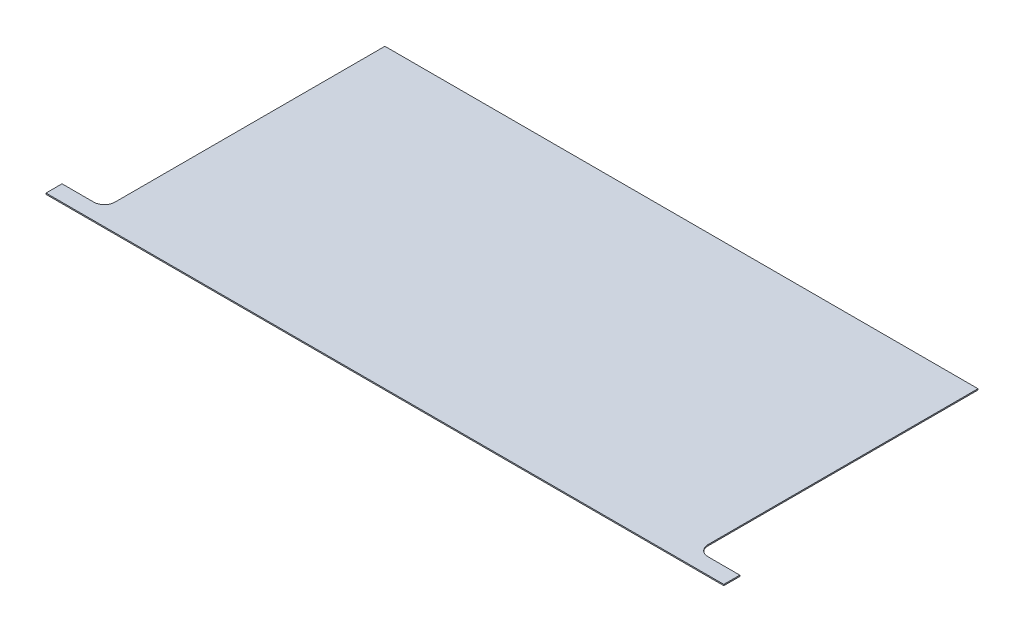
ISO-10303-21;
HEADER;
FILE_DESCRIPTION(('STEP AP214'),'2;1');
FILE_NAME('part.step','',(''),(''),'','','');
FILE_SCHEMA(('AUTOMOTIVE_DESIGN { 1 0 10303 214 1 1 1 1 }'));
ENDSEC;
DATA;
#1=APPLICATION_CONTEXT('core data for automotive mechanical design processes');
#2=APPLICATION_PROTOCOL_DEFINITION('international standard','automotive_design',2000,#1);
#3=PRODUCT_CONTEXT('',#1,'mechanical');
#4=PRODUCT('Part','Part','',(#3));
#5=PRODUCT_RELATED_PRODUCT_CATEGORY('part','',(#4));
#6=PRODUCT_DEFINITION_FORMATION('','',#4);
#7=PRODUCT_DEFINITION_CONTEXT('part definition',#1,'design');
#8=PRODUCT_DEFINITION('design','',#6,#7);
#9=PRODUCT_DEFINITION_SHAPE('','',#8);
#10=(LENGTH_UNIT() NAMED_UNIT(*) SI_UNIT(.MILLI.,.METRE.));
#11=(NAMED_UNIT(*) PLANE_ANGLE_UNIT() SI_UNIT($,.RADIAN.));
#12=(NAMED_UNIT(*) SI_UNIT($,.STERADIAN.) SOLID_ANGLE_UNIT());
#13=UNCERTAINTY_MEASURE_WITH_UNIT(LENGTH_MEASURE(1.E-05),#10,'distance_accuracy_value','');
#14=(GEOMETRIC_REPRESENTATION_CONTEXT(3) GLOBAL_UNCERTAINTY_ASSIGNED_CONTEXT((#13)) GLOBAL_UNIT_ASSIGNED_CONTEXT((#10,
#11,#12)) REPRESENTATION_CONTEXT('',''));
#15=CARTESIAN_POINT('',(0.,0.,0.));
#16=DIRECTION('',(0.,0.,1.));
#17=DIRECTION('',(1.,0.,0.));
#18=AXIS2_PLACEMENT_3D('',#15,#16,#17);
#19=CARTESIAN_POINT('',(203.2,0.3556,0.));
#20=DIRECTION('',(0.,0.,-1.));
#21=DIRECTION('',(-1.,0.,0.));
#22=AXIS2_PLACEMENT_3D('',#19,#20,#21);
#23=PLANE('',#22);
#24=DIRECTION('',(1.,0.,0.));
#25=VECTOR('',#24,1.);
#26=CARTESIAN_POINT('',(203.2,0.,0.));
#27=LINE('',#26,#25);
#28=CARTESIAN_POINT('',(0.,0.,0.));
#29=VERTEX_POINT('',#28);
#30=CARTESIAN_POINT('',(203.2,0.,0.));
#31=VERTEX_POINT('',#30);
#32=EDGE_CURVE('E124',#29,#31,#27,.T.);
#33=ORIENTED_EDGE('',*,*,#32,.T.);
#34=DIRECTION('',(0.,-1.,0.));
#35=VECTOR('',#34,1.);
#36=CARTESIAN_POINT('',(203.2,0.3556,0.));
#37=LINE('',#36,#35);
#38=CARTESIAN_POINT('',(203.2,0.3556,0.));
#39=VERTEX_POINT('',#38);
#40=EDGE_CURVE('E123',#39,#31,#37,.T.);
#41=ORIENTED_EDGE('',*,*,#40,.F.);
#42=DIRECTION('',(1.,0.,0.));
#43=VECTOR('',#42,1.);
#44=CARTESIAN_POINT('',(0.,0.3556,0.));
#45=LINE('',#44,#43);
#46=CARTESIAN_POINT('',(0.,0.3556,0.));
#47=VERTEX_POINT('',#46);
#48=EDGE_CURVE('E108',#47,#39,#45,.T.);
#49=ORIENTED_EDGE('',*,*,#48,.F.);
#50=DIRECTION('',(0.,-1.,0.));
#51=VECTOR('',#50,1.);
#52=CARTESIAN_POINT('',(0.,0.3556,0.));
#53=LINE('',#52,#51);
#54=EDGE_CURVE('E146',#47,#29,#53,.T.);
#55=ORIENTED_EDGE('',*,*,#54,.T.);
#56=EDGE_LOOP('',(#33,#41,#49,#55));
#57=FACE_BOUND('',#56,.T.);
#58=ADVANCED_FACE('F32',(#57),#23,.F.);
#59=CARTESIAN_POINT('',(203.2,0.3556,-4.80000000000003));
#60=DIRECTION('',(-1.,0.,0.));
#61=DIRECTION('',(0.,0.,1.));
#62=AXIS2_PLACEMENT_3D('',#59,#60,#61);
#63=PLANE('',#62);
#64=DIRECTION('',(0.,0.,-1.));
#65=VECTOR('',#64,1.);
#66=CARTESIAN_POINT('',(203.2,0.,-4.80000000000003));
#67=LINE('',#66,#65);
#68=CARTESIAN_POINT('',(203.2,0.,-4.80000000000003));
#69=VERTEX_POINT('',#68);
#70=EDGE_CURVE('E148',#31,#69,#67,.T.);
#71=ORIENTED_EDGE('',*,*,#70,.T.);
#72=DIRECTION('',(0.,-1.,0.));
#73=VECTOR('',#72,1.);
#74=CARTESIAN_POINT('',(203.2,0.3556,-4.80000000000003));
#75=LINE('',#74,#73);
#76=CARTESIAN_POINT('',(203.2,0.3556,-4.80000000000003));
#77=VERTEX_POINT('',#76);
#78=EDGE_CURVE('E128',#77,#69,#75,.T.);
#79=ORIENTED_EDGE('',*,*,#78,.F.);
#80=DIRECTION('',(0.,0.,-1.));
#81=VECTOR('',#80,1.);
#82=CARTESIAN_POINT('',(203.2,0.3556,-4.80000000000003));
#83=LINE('',#82,#81);
#84=EDGE_CURVE('E113',#39,#77,#83,.T.);
#85=ORIENTED_EDGE('',*,*,#84,.F.);
#86=ORIENTED_EDGE('',*,*,#40,.T.);
#87=EDGE_LOOP('',(#71,#79,#85,#86));
#88=FACE_BOUND('',#87,.T.);
#89=ADVANCED_FACE('F130',(#88),#63,.F.);
#90=CARTESIAN_POINT('',(190.5,0.3556,-4.80000000000003));
#91=DIRECTION('',(0.,0.,1.));
#92=DIRECTION('',(1.,0.,0.));
#93=AXIS2_PLACEMENT_3D('',#90,#91,#92);
#94=PLANE('',#93);
#95=DIRECTION('',(-1.,0.,0.));
#96=VECTOR('',#95,1.);
#97=CARTESIAN_POINT('',(190.5,0.,-4.80000000000003));
#98=LINE('',#97,#96);
#99=CARTESIAN_POINT('',(193.675,0.,-4.80000000000003));
#100=VERTEX_POINT('',#99);
#101=EDGE_CURVE('E150',#69,#100,#98,.T.);
#102=ORIENTED_EDGE('',*,*,#101,.T.);
#103=DIRECTION('',(0.,-1.,0.));
#104=VECTOR('',#103,1.);
#105=CARTESIAN_POINT('',(193.675,0.3556,-4.80000000000003));
#106=LINE('',#105,#104);
#107=CARTESIAN_POINT('',(193.675,0.3556,-4.80000000000003));
#108=VERTEX_POINT('',#107);
#109=EDGE_CURVE('E176',#100,#108,#106,.F.);
#110=ORIENTED_EDGE('',*,*,#109,.T.);
#111=DIRECTION('',(-1.,0.,0.));
#112=VECTOR('',#111,1.);
#113=CARTESIAN_POINT('',(190.5,0.3556,-4.80000000000003));
#114=LINE('',#113,#112);
#115=EDGE_CURVE('E133',#77,#108,#114,.T.);
#116=ORIENTED_EDGE('',*,*,#115,.F.);
#117=ORIENTED_EDGE('',*,*,#78,.T.);
#118=EDGE_LOOP('',(#102,#110,#116,#117));
#119=FACE_BOUND('',#118,.T.);
#120=ADVANCED_FACE('F200',(#119),#94,.F.);
#121=CARTESIAN_POINT('',(190.5,0.3556,-88.9));
#122=DIRECTION('',(-1.,0.,0.));
#123=DIRECTION('',(0.,0.,1.));
#124=AXIS2_PLACEMENT_3D('',#121,#122,#123);
#125=PLANE('',#124);
#126=DIRECTION('',(0.,0.,-1.));
#127=VECTOR('',#126,1.);
#128=CARTESIAN_POINT('',(190.5,0.3556,-88.9));
#129=LINE('',#128,#127);
#130=CARTESIAN_POINT('',(190.5,0.3556,-7.97500000000002));
#131=VERTEX_POINT('',#130);
#132=CARTESIAN_POINT('',(190.5,0.3556,-88.9));
#133=VERTEX_POINT('',#132);
#134=EDGE_CURVE('E135',#131,#133,#129,.T.);
#135=ORIENTED_EDGE('',*,*,#134,.F.);
#136=DIRECTION('',(0.,-1.,0.));
#137=VECTOR('',#136,1.);
#138=CARTESIAN_POINT('',(190.5,0.,-7.97500000000002));
#139=LINE('',#138,#137);
#140=CARTESIAN_POINT('',(190.5,0.,-7.97500000000002));
#141=VERTEX_POINT('',#140);
#142=EDGE_CURVE('E127',#131,#141,#139,.T.);
#143=ORIENTED_EDGE('',*,*,#142,.T.);
#144=DIRECTION('',(0.,0.,-1.));
#145=VECTOR('',#144,1.);
#146=CARTESIAN_POINT('',(190.5,0.,-88.9));
#147=LINE('',#146,#145);
#148=CARTESIAN_POINT('',(190.5,0.,-88.9));
#149=VERTEX_POINT('',#148);
#150=EDGE_CURVE('E153',#141,#149,#147,.T.);
#151=ORIENTED_EDGE('',*,*,#150,.T.);
#152=DIRECTION('',(0.,-1.,0.));
#153=VECTOR('',#152,1.);
#154=CARTESIAN_POINT('',(190.5,0.3556,-88.9));
#155=LINE('',#154,#153);
#156=EDGE_CURVE('E170',#133,#149,#155,.T.);
#157=ORIENTED_EDGE('',*,*,#156,.F.);
#158=EDGE_LOOP('',(#135,#143,#151,#157));
#159=FACE_BOUND('',#158,.T.);
#160=ADVANCED_FACE('F192',(#159),#125,.F.);
#161=CARTESIAN_POINT('',(12.7,0.3556,-88.9));
#162=DIRECTION('',(0.,0.,1.));
#163=DIRECTION('',(1.,0.,0.));
#164=AXIS2_PLACEMENT_3D('',#161,#162,#163);
#165=PLANE('',#164);
#166=DIRECTION('',(-1.,0.,0.));
#167=VECTOR('',#166,1.);
#168=CARTESIAN_POINT('',(12.7,0.,-88.9));
#169=LINE('',#168,#167);
#170=CARTESIAN_POINT('',(12.7,0.,-88.9));
#171=VERTEX_POINT('',#170);
#172=EDGE_CURVE('E155',#149,#171,#169,.T.);
#173=ORIENTED_EDGE('',*,*,#172,.T.);
#174=DIRECTION('',(0.,-1.,0.));
#175=VECTOR('',#174,1.);
#176=CARTESIAN_POINT('',(12.7,0.3556,-88.9));
#177=LINE('',#176,#175);
#178=CARTESIAN_POINT('',(12.7,0.3556,-88.9));
#179=VERTEX_POINT('',#178);
#180=EDGE_CURVE('E167',#179,#171,#177,.T.);
#181=ORIENTED_EDGE('',*,*,#180,.F.);
#182=DIRECTION('',(-1.,0.,0.));
#183=VECTOR('',#182,1.);
#184=CARTESIAN_POINT('',(12.7,0.3556,-88.9));
#185=LINE('',#184,#183);
#186=EDGE_CURVE('E139',#133,#179,#185,.T.);
#187=ORIENTED_EDGE('',*,*,#186,.F.);
#188=ORIENTED_EDGE('',*,*,#156,.T.);
#189=EDGE_LOOP('',(#173,#181,#187,#188));
#190=FACE_BOUND('',#189,.T.);
#191=ADVANCED_FACE('F207',(#190),#165,.F.);
#192=CARTESIAN_POINT('',(12.7,0.3556,-88.9));
#193=DIRECTION('',(1.,0.,0.));
#194=DIRECTION('',(0.,0.,-1.));
#195=AXIS2_PLACEMENT_3D('',#192,#193,#194);
#196=PLANE('',#195);
#197=DIRECTION('',(0.,0.,1.));
#198=VECTOR('',#197,1.);
#199=CARTESIAN_POINT('',(12.7,0.,-88.9));
#200=LINE('',#199,#198);
#201=CARTESIAN_POINT('',(12.7,0.,-7.975));
#202=VERTEX_POINT('',#201);
#203=EDGE_CURVE('E157',#171,#202,#200,.T.);
#204=ORIENTED_EDGE('',*,*,#203,.T.);
#205=DIRECTION('',(0.,-1.,0.));
#206=VECTOR('',#205,1.);
#207=CARTESIAN_POINT('',(12.7,0.3556,-7.975));
#208=LINE('',#207,#206);
#209=CARTESIAN_POINT('',(12.7,0.3556,-7.975));
#210=VERTEX_POINT('',#209);
#211=EDGE_CURVE('E47',#202,#210,#208,.F.);
#212=ORIENTED_EDGE('',*,*,#211,.T.);
#213=DIRECTION('',(0.,0.,1.));
#214=VECTOR('',#213,1.);
#215=CARTESIAN_POINT('',(12.7,0.3556,-88.9));
#216=LINE('',#215,#214);
#217=EDGE_CURVE('E141',#179,#210,#216,.T.);
#218=ORIENTED_EDGE('',*,*,#217,.F.);
#219=ORIENTED_EDGE('',*,*,#180,.T.);
#220=EDGE_LOOP('',(#204,#212,#218,#219));
#221=FACE_BOUND('',#220,.T.);
#222=ADVANCED_FACE('F233',(#221),#196,.F.);
#223=CARTESIAN_POINT('',(12.7,0.3556,-4.8));
#224=DIRECTION('',(0.,0.,1.));
#225=DIRECTION('',(1.,0.,0.));
#226=AXIS2_PLACEMENT_3D('',#223,#224,#225);
#227=PLANE('',#226);
#228=DIRECTION('',(-1.,0.,0.));
#229=VECTOR('',#228,1.);
#230=CARTESIAN_POINT('',(12.7,0.3556,-4.8));
#231=LINE('',#230,#229);
#232=CARTESIAN_POINT('',(9.525,0.3556,-4.8));
#233=VERTEX_POINT('',#232);
#234=CARTESIAN_POINT('',(0.,0.3556,-4.8));
#235=VERTEX_POINT('',#234);
#236=EDGE_CURVE('E143',#233,#235,#231,.T.);
#237=ORIENTED_EDGE('',*,*,#236,.F.);
#238=DIRECTION('',(0.,-1.,0.));
#239=VECTOR('',#238,1.);
#240=CARTESIAN_POINT('',(9.525,0.,-4.8));
#241=LINE('',#240,#239);
#242=CARTESIAN_POINT('',(9.525,0.,-4.8));
#243=VERTEX_POINT('',#242);
#244=EDGE_CURVE('E178',#233,#243,#241,.T.);
#245=ORIENTED_EDGE('',*,*,#244,.T.);
#246=DIRECTION('',(-1.,0.,0.));
#247=VECTOR('',#246,1.);
#248=CARTESIAN_POINT('',(12.7,0.,-4.8));
#249=LINE('',#248,#247);
#250=CARTESIAN_POINT('',(0.,0.,-4.8));
#251=VERTEX_POINT('',#250);
#252=EDGE_CURVE('E159',#243,#251,#249,.T.);
#253=ORIENTED_EDGE('',*,*,#252,.T.);
#254=DIRECTION('',(0.,-1.,0.));
#255=VECTOR('',#254,1.);
#256=CARTESIAN_POINT('',(0.,0.3556,-4.8));
#257=LINE('',#256,#255);
#258=EDGE_CURVE('E164',#235,#251,#257,.T.);
#259=ORIENTED_EDGE('',*,*,#258,.F.);
#260=EDGE_LOOP('',(#237,#245,#253,#259));
#261=FACE_BOUND('',#260,.T.);
#262=ADVANCED_FACE('F229',(#261),#227,.F.);
#263=CARTESIAN_POINT('',(0.,0.3556,-4.8));
#264=DIRECTION('',(1.,0.,0.));
#265=DIRECTION('',(0.,0.,-1.));
#266=AXIS2_PLACEMENT_3D('',#263,#264,#265);
#267=PLANE('',#266);
#268=DIRECTION('',(0.,0.,1.));
#269=VECTOR('',#268,1.);
#270=CARTESIAN_POINT('',(0.,0.,-4.8));
#271=LINE('',#270,#269);
#272=EDGE_CURVE('E120',#251,#29,#271,.T.);
#273=ORIENTED_EDGE('',*,*,#272,.T.);
#274=ORIENTED_EDGE('',*,*,#54,.F.);
#275=DIRECTION('',(0.,0.,1.));
#276=VECTOR('',#275,1.);
#277=CARTESIAN_POINT('',(0.,0.3556,-4.8));
#278=LINE('',#277,#276);
#279=EDGE_CURVE('E116',#235,#47,#278,.T.);
#280=ORIENTED_EDGE('',*,*,#279,.F.);
#281=ORIENTED_EDGE('',*,*,#258,.T.);
#282=EDGE_LOOP('',(#273,#274,#280,#281));
#283=FACE_BOUND('',#282,.T.);
#284=ADVANCED_FACE('F224',(#283),#267,.F.);
#285=CARTESIAN_POINT('',(0.,0.3556,0.));
#286=DIRECTION('',(0.,-1.,0.));
#287=DIRECTION('',(0.,0.,-1.));
#288=AXIS2_PLACEMENT_3D('',#285,#286,#287);
#289=PLANE('',#288);
#290=ORIENTED_EDGE('',*,*,#48,.T.);
#291=ORIENTED_EDGE('',*,*,#84,.T.);
#292=ORIENTED_EDGE('',*,*,#115,.T.);
#293=CARTESIAN_POINT('',(193.675,0.3556,-7.97500000000002));
#294=DIRECTION('',(0.,-1.,0.));
#295=DIRECTION('',(0.,0.,-1.));
#296=AXIS2_PLACEMENT_3D('',#293,#294,#295);
#297=CIRCLE('',#296,3.175);
#298=EDGE_CURVE('E184',#108,#131,#297,.T.);
#299=ORIENTED_EDGE('',*,*,#298,.T.);
#300=ORIENTED_EDGE('',*,*,#134,.T.);
#301=ORIENTED_EDGE('',*,*,#186,.T.);
#302=ORIENTED_EDGE('',*,*,#217,.T.);
#303=CARTESIAN_POINT('',(9.525,0.3556,-7.975));
#304=DIRECTION('',(0.,-1.,0.));
#305=DIRECTION('',(0.,0.,-1.));
#306=AXIS2_PLACEMENT_3D('',#303,#304,#305);
#307=CIRCLE('',#306,3.175);
#308=EDGE_CURVE('E11',#210,#233,#307,.T.);
#309=ORIENTED_EDGE('',*,*,#308,.T.);
#310=ORIENTED_EDGE('',*,*,#236,.T.);
#311=ORIENTED_EDGE('',*,*,#279,.T.);
#312=EDGE_LOOP('',(#290,#291,#292,#299,#300,#301,#302,#309,#310,#311));
#313=FACE_BOUND('',#312,.T.);
#314=ADVANCED_FACE('F110',(#313),#289,.F.);
#315=CARTESIAN_POINT('',(0.,0.,0.));
#316=DIRECTION('',(0.,-1.,0.));
#317=DIRECTION('',(0.,0.,-1.));
#318=AXIS2_PLACEMENT_3D('',#315,#316,#317);
#319=PLANE('',#318);
#320=ORIENTED_EDGE('',*,*,#32,.F.);
#321=ORIENTED_EDGE('',*,*,#272,.F.);
#322=ORIENTED_EDGE('',*,*,#252,.F.);
#323=CARTESIAN_POINT('',(9.525,0.,-7.975));
#324=DIRECTION('',(0.,-1.,0.));
#325=DIRECTION('',(0.,0.,-1.));
#326=AXIS2_PLACEMENT_3D('',#323,#324,#325);
#327=CIRCLE('',#326,3.175);
#328=EDGE_CURVE('E40',#243,#202,#327,.F.);
#329=ORIENTED_EDGE('',*,*,#328,.T.);
#330=ORIENTED_EDGE('',*,*,#203,.F.);
#331=ORIENTED_EDGE('',*,*,#172,.F.);
#332=ORIENTED_EDGE('',*,*,#150,.F.);
#333=CARTESIAN_POINT('',(193.675,0.,-7.97500000000002));
#334=DIRECTION('',(0.,-1.,0.));
#335=DIRECTION('',(0.,0.,-1.));
#336=AXIS2_PLACEMENT_3D('',#333,#334,#335);
#337=CIRCLE('',#336,3.175);
#338=EDGE_CURVE('E182',#141,#100,#337,.F.);
#339=ORIENTED_EDGE('',*,*,#338,.T.);
#340=ORIENTED_EDGE('',*,*,#101,.F.);
#341=ORIENTED_EDGE('',*,*,#70,.F.);
#342=EDGE_LOOP('',(#320,#321,#322,#329,#330,#331,#332,#339,#340,#341));
#343=FACE_BOUND('',#342,.T.);
#344=ADVANCED_FACE('F197',(#343),#319,.T.);
#345=CARTESIAN_POINT('',(193.675,0.3556,-7.97500000000002));
#346=DIRECTION('',(0.,1.,0.));
#347=DIRECTION('',(0.,0.,1.));
#348=AXIS2_PLACEMENT_3D('',#345,#346,#347);
#349=CYLINDRICAL_SURFACE('',#348,3.175);
#350=ORIENTED_EDGE('',*,*,#298,.F.);
#351=ORIENTED_EDGE('',*,*,#109,.F.);
#352=ORIENTED_EDGE('',*,*,#338,.F.);
#353=ORIENTED_EDGE('',*,*,#142,.F.);
#354=EDGE_LOOP('',(#350,#351,#352,#353));
#355=FACE_BOUND('',#354,.T.);
#356=ADVANCED_FACE('F195',(#355),#349,.F.);
#357=CARTESIAN_POINT('',(9.525,0.3556,-7.975));
#358=DIRECTION('',(0.,1.,0.));
#359=DIRECTION('',(0.,0.,1.));
#360=AXIS2_PLACEMENT_3D('',#357,#358,#359);
#361=CYLINDRICAL_SURFACE('',#360,3.175);
#362=ORIENTED_EDGE('',*,*,#308,.F.);
#363=ORIENTED_EDGE('',*,*,#211,.F.);
#364=ORIENTED_EDGE('',*,*,#328,.F.);
#365=ORIENTED_EDGE('',*,*,#244,.F.);
#366=EDGE_LOOP('',(#362,#363,#364,#365));
#367=FACE_BOUND('',#366,.T.);
#368=ADVANCED_FACE('F34',(#367),#361,.F.);
#369=CLOSED_SHELL('',(#58,#89,#120,#160,#191,#222,#262,#284,#314,#344,#356,#368));
#370=MANIFOLD_SOLID_BREP('B2',#369);
#371=ADVANCED_BREP_SHAPE_REPRESENTATION('',(#18,#370),#14);
#372=SHAPE_DEFINITION_REPRESENTATION(#9,#371);
ENDSEC;
END-ISO-10303-21;
